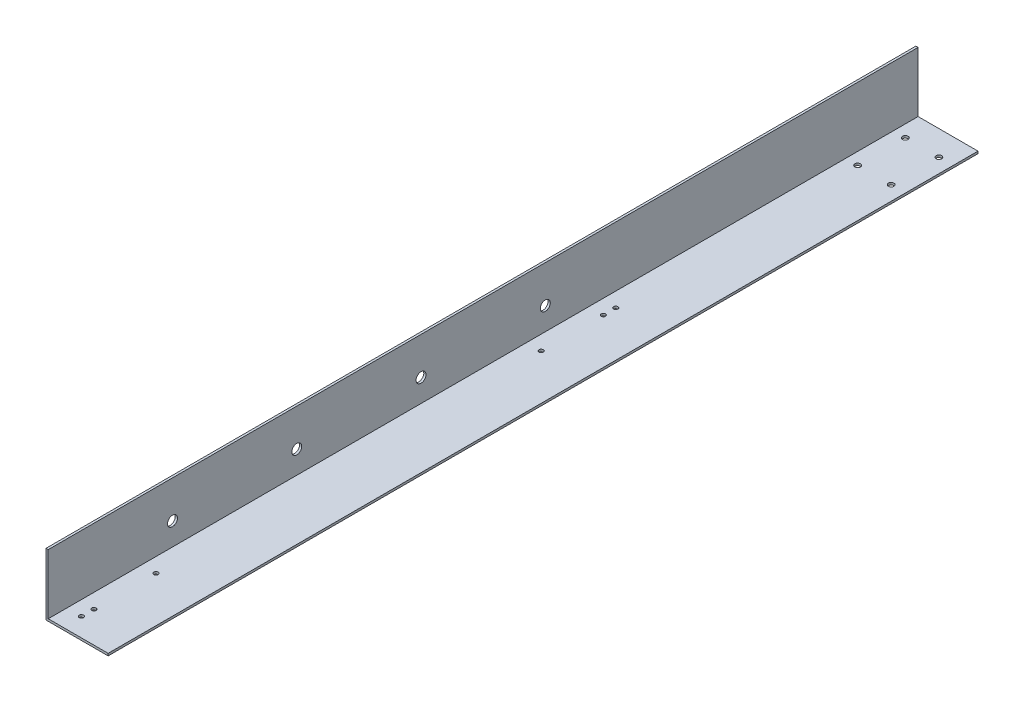
ISO-10303-21;
HEADER;
FILE_DESCRIPTION(('STEP AP214'),'2;1');
FILE_NAME('part.step','',(''),(''),'','','');
FILE_SCHEMA(('AUTOMOTIVE_DESIGN { 1 0 10303 214 1 1 1 1 }'));
ENDSEC;
DATA;
#1=APPLICATION_CONTEXT('core data for automotive mechanical design processes');
#2=APPLICATION_PROTOCOL_DEFINITION('international standard','automotive_design',2000,#1);
#3=PRODUCT_CONTEXT('',#1,'mechanical');
#4=PRODUCT('Part','Part','',(#3));
#5=PRODUCT_RELATED_PRODUCT_CATEGORY('part','',(#4));
#6=PRODUCT_DEFINITION_FORMATION('','',#4);
#7=PRODUCT_DEFINITION_CONTEXT('part definition',#1,'design');
#8=PRODUCT_DEFINITION('design','',#6,#7);
#9=PRODUCT_DEFINITION_SHAPE('','',#8);
#10=(LENGTH_UNIT() NAMED_UNIT(*) SI_UNIT(.MILLI.,.METRE.));
#11=(NAMED_UNIT(*) PLANE_ANGLE_UNIT() SI_UNIT($,.RADIAN.));
#12=(NAMED_UNIT(*) SI_UNIT($,.STERADIAN.) SOLID_ANGLE_UNIT());
#13=UNCERTAINTY_MEASURE_WITH_UNIT(LENGTH_MEASURE(1.E-05),#10,'distance_accuracy_value','');
#14=(GEOMETRIC_REPRESENTATION_CONTEXT(3) GLOBAL_UNCERTAINTY_ASSIGNED_CONTEXT((#13)) GLOBAL_UNIT_ASSIGNED_CONTEXT((#10,
#11,#12)) REPRESENTATION_CONTEXT('',''));
#15=CARTESIAN_POINT('',(0.,0.,0.));
#16=DIRECTION('',(0.,0.,1.));
#17=DIRECTION('',(1.,0.,0.));
#18=AXIS2_PLACEMENT_3D('',#15,#16,#17);
#19=CARTESIAN_POINT('',(0.,0.,700.));
#20=DIRECTION('',(0.,1.,0.));
#21=DIRECTION('',(0.,0.,1.));
#22=AXIS2_PLACEMENT_3D('',#19,#20,#21);
#23=PLANE('',#22);
#24=CARTESIAN_POINT('',(13.5,0.,685.));
#25=DIRECTION('',(0.,-1.,0.));
#26=DIRECTION('',(0.,0.,-1.));
#27=AXIS2_PLACEMENT_3D('',#24,#25,#26);
#28=CIRCLE('',#27,1.75);
#29=CARTESIAN_POINT('',(13.5,0.,683.25));
#30=VERTEX_POINT('',#29);
#31=EDGE_CURVE('E292',#30,#30,#28,.T.);
#32=ORIENTED_EDGE('',*,*,#31,.F.);
#33=EDGE_LOOP('',(#32));
#34=FACE_BOUND('',#33,.T.);
#35=CARTESIAN_POINT('',(13.5,0.,675.));
#36=DIRECTION('',(0.,-1.,0.));
#37=DIRECTION('',(0.,0.,-1.));
#38=AXIS2_PLACEMENT_3D('',#35,#36,#37);
#39=CIRCLE('',#38,1.75);
#40=CARTESIAN_POINT('',(13.5,0.,673.25));
#41=VERTEX_POINT('',#40);
#42=EDGE_CURVE('E294',#41,#41,#39,.T.);
#43=ORIENTED_EDGE('',*,*,#42,.F.);
#44=EDGE_LOOP('',(#43));
#45=FACE_BOUND('',#44,.T.);
#46=CARTESIAN_POINT('',(13.5,0.,625.));
#47=DIRECTION('',(0.,-1.,0.));
#48=DIRECTION('',(0.,0.,-1.));
#49=AXIS2_PLACEMENT_3D('',#46,#47,#48);
#50=CIRCLE('',#49,1.75);
#51=CARTESIAN_POINT('',(13.5,0.,623.25));
#52=VERTEX_POINT('',#51);
#53=EDGE_CURVE('E302',#52,#52,#50,.T.);
#54=ORIENTED_EDGE('',*,*,#53,.F.);
#55=EDGE_LOOP('',(#54));
#56=FACE_BOUND('',#55,.T.);
#57=CARTESIAN_POINT('',(13.5,0.,255.));
#58=DIRECTION('',(0.,-1.,0.));
#59=DIRECTION('',(0.,0.,-1.));
#60=AXIS2_PLACEMENT_3D('',#57,#58,#59);
#61=CIRCLE('',#60,1.75);
#62=CARTESIAN_POINT('',(13.5,0.,253.25));
#63=VERTEX_POINT('',#62);
#64=EDGE_CURVE('E308',#63,#63,#61,.T.);
#65=ORIENTED_EDGE('',*,*,#64,.F.);
#66=EDGE_LOOP('',(#65));
#67=FACE_BOUND('',#66,.T.);
#68=CARTESIAN_POINT('',(13.5,0.,265.));
#69=DIRECTION('',(0.,-1.,0.));
#70=DIRECTION('',(0.,0.,-1.));
#71=AXIS2_PLACEMENT_3D('',#68,#69,#70);
#72=CIRCLE('',#71,1.75);
#73=CARTESIAN_POINT('',(13.5,0.,263.25));
#74=VERTEX_POINT('',#73);
#75=EDGE_CURVE('E314',#74,#74,#72,.T.);
#76=ORIENTED_EDGE('',*,*,#75,.F.);
#77=EDGE_LOOP('',(#76));
#78=FACE_BOUND('',#77,.T.);
#79=DIRECTION('',(1.,0.,0.));
#80=VECTOR('',#79,1.);
#81=CARTESIAN_POINT('',(0.,0.,0.));
#82=LINE('',#81,#80);
#83=CARTESIAN_POINT('',(0.,0.,0.));
#84=VERTEX_POINT('',#83);
#85=CARTESIAN_POINT('',(50.,0.,0.));
#86=VERTEX_POINT('',#85);
#87=EDGE_CURVE('E110',#84,#86,#82,.T.);
#88=ORIENTED_EDGE('',*,*,#87,.T.);
#89=DIRECTION('',(0.,0.,-1.));
#90=VECTOR('',#89,1.);
#91=CARTESIAN_POINT('',(50.,0.,700.));
#92=LINE('',#91,#90);
#93=CARTESIAN_POINT('',(50.,0.,700.));
#94=VERTEX_POINT('',#93);
#95=EDGE_CURVE('E107',#94,#86,#92,.T.);
#96=ORIENTED_EDGE('',*,*,#95,.F.);
#97=DIRECTION('',(1.,0.,0.));
#98=VECTOR('',#97,1.);
#99=CARTESIAN_POINT('',(0.,0.,700.));
#100=LINE('',#99,#98);
#101=CARTESIAN_POINT('',(0.,0.,700.));
#102=VERTEX_POINT('',#101);
#103=EDGE_CURVE('E95',#102,#94,#100,.T.);
#104=ORIENTED_EDGE('',*,*,#103,.F.);
#105=DIRECTION('',(0.,0.,-1.));
#106=VECTOR('',#105,1.);
#107=CARTESIAN_POINT('',(0.,0.,700.));
#108=LINE('',#107,#106);
#109=EDGE_CURVE('E45',#102,#84,#108,.T.);
#110=ORIENTED_EDGE('',*,*,#109,.T.);
#111=EDGE_LOOP('',(#88,#96,#104,#110));
#112=FACE_BOUND('',#111,.T.);
#113=CARTESIAN_POINT('',(38.5,0.,20.));
#114=DIRECTION('',(0.,-1.,0.));
#115=DIRECTION('',(0.,0.,-1.));
#116=AXIS2_PLACEMENT_3D('',#113,#114,#115);
#117=CIRCLE('',#116,2.25);
#118=CARTESIAN_POINT('',(38.5,0.,17.75));
#119=VERTEX_POINT('',#118);
#120=EDGE_CURVE('E146',#119,#119,#117,.T.);
#121=ORIENTED_EDGE('',*,*,#120,.F.);
#122=EDGE_LOOP('',(#121));
#123=FACE_BOUND('',#122,.T.);
#124=CARTESIAN_POINT('',(38.5,0.,58.34));
#125=DIRECTION('',(0.,-1.,0.));
#126=DIRECTION('',(0.,0.,-1.));
#127=AXIS2_PLACEMENT_3D('',#124,#125,#126);
#128=CIRCLE('',#127,2.25);
#129=CARTESIAN_POINT('',(38.5,0.,56.09));
#130=VERTEX_POINT('',#129);
#131=EDGE_CURVE('E150',#130,#130,#128,.T.);
#132=ORIENTED_EDGE('',*,*,#131,.F.);
#133=EDGE_LOOP('',(#132));
#134=FACE_BOUND('',#133,.T.);
#135=CARTESIAN_POINT('',(11.5,0.,20.));
#136=DIRECTION('',(0.,-1.,0.));
#137=DIRECTION('',(0.,0.,-1.));
#138=AXIS2_PLACEMENT_3D('',#135,#136,#137);
#139=CIRCLE('',#138,2.25);
#140=CARTESIAN_POINT('',(11.5,0.,17.75));
#141=VERTEX_POINT('',#140);
#142=EDGE_CURVE('E154',#141,#141,#139,.T.);
#143=ORIENTED_EDGE('',*,*,#142,.F.);
#144=EDGE_LOOP('',(#143));
#145=FACE_BOUND('',#144,.T.);
#146=CARTESIAN_POINT('',(11.5,0.,58.34));
#147=DIRECTION('',(0.,-1.,0.));
#148=DIRECTION('',(0.,0.,-1.));
#149=AXIS2_PLACEMENT_3D('',#146,#147,#148);
#150=CIRCLE('',#149,2.25);
#151=CARTESIAN_POINT('',(11.5,0.,56.09));
#152=VERTEX_POINT('',#151);
#153=EDGE_CURVE('E158',#152,#152,#150,.T.);
#154=ORIENTED_EDGE('',*,*,#153,.F.);
#155=EDGE_LOOP('',(#154));
#156=FACE_BOUND('',#155,.T.);
#157=CARTESIAN_POINT('',(13.5,0.,315.));
#158=DIRECTION('',(0.,-1.,0.));
#159=DIRECTION('',(0.,0.,-1.));
#160=AXIS2_PLACEMENT_3D('',#157,#158,#159);
#161=CIRCLE('',#160,1.75);
#162=CARTESIAN_POINT('',(13.5,0.,313.25));
#163=VERTEX_POINT('',#162);
#164=EDGE_CURVE('E182',#163,#163,#161,.T.);
#165=ORIENTED_EDGE('',*,*,#164,.F.);
#166=EDGE_LOOP('',(#165));
#167=FACE_BOUND('',#166,.T.);
#168=ADVANCED_FACE('F35',(#34,#45,#56,#67,#78,#112,#123,#134,#145,#156,#167),#23,.F.);
#169=CARTESIAN_POINT('',(0.,50.,700.));
#170=DIRECTION('',(0.,1.,0.));
#171=DIRECTION('',(-1.,0.,0.));
#172=AXIS2_PLACEMENT_3D('',#169,#170,#171);
#173=PLANE('',#172);
#174=DIRECTION('',(1.,0.,0.));
#175=VECTOR('',#174,1.);
#176=CARTESIAN_POINT('',(0.,50.,0.));
#177=LINE('',#176,#175);
#178=CARTESIAN_POINT('',(0.,50.,0.));
#179=VERTEX_POINT('',#178);
#180=CARTESIAN_POINT('',(1.8,50.,0.));
#181=VERTEX_POINT('',#180);
#182=EDGE_CURVE('E124',#179,#181,#177,.T.);
#183=ORIENTED_EDGE('',*,*,#182,.F.);
#184=DIRECTION('',(0.,0.,-1.));
#185=VECTOR('',#184,1.);
#186=CARTESIAN_POINT('',(0.,50.,700.));
#187=LINE('',#186,#185);
#188=CARTESIAN_POINT('',(0.,50.,700.));
#189=VERTEX_POINT('',#188);
#190=EDGE_CURVE('E11',#189,#179,#187,.T.);
#191=ORIENTED_EDGE('',*,*,#190,.F.);
#192=DIRECTION('',(1.,0.,0.));
#193=VECTOR('',#192,1.);
#194=CARTESIAN_POINT('',(0.,50.,700.));
#195=LINE('',#194,#193);
#196=CARTESIAN_POINT('',(1.8,50.,700.));
#197=VERTEX_POINT('',#196);
#198=EDGE_CURVE('E137',#189,#197,#195,.T.);
#199=ORIENTED_EDGE('',*,*,#198,.T.);
#200=DIRECTION('',(0.,0.,-1.));
#201=VECTOR('',#200,1.);
#202=CARTESIAN_POINT('',(1.8,50.,700.));
#203=LINE('',#202,#201);
#204=EDGE_CURVE('E84',#197,#181,#203,.T.);
#205=ORIENTED_EDGE('',*,*,#204,.T.);
#206=EDGE_LOOP('',(#183,#191,#199,#205));
#207=FACE_BOUND('',#206,.T.);
#208=ADVANCED_FACE('F37',(#207),#173,.T.);
#209=CARTESIAN_POINT('',(0.,50.,700.));
#210=DIRECTION('',(1.,0.,0.));
#211=DIRECTION('',(0.,1.,0.));
#212=AXIS2_PLACEMENT_3D('',#209,#210,#211);
#213=PLANE('',#212);
#214=CARTESIAN_POINT('',(0.,20.,300.));
#215=DIRECTION('',(-1.,0.,0.));
#216=DIRECTION('',(0.,-1.,0.));
#217=AXIS2_PLACEMENT_3D('',#214,#215,#216);
#218=CIRCLE('',#217,3.99999999999994);
#219=CARTESIAN_POINT('',(0.,16.,300.));
#220=VERTEX_POINT('',#219);
#221=EDGE_CURVE('E172',#220,#220,#218,.T.);
#222=ORIENTED_EDGE('',*,*,#221,.F.);
#223=EDGE_LOOP('',(#222));
#224=FACE_BOUND('',#223,.T.);
#225=CARTESIAN_POINT('',(0.,20.,400.));
#226=DIRECTION('',(-1.,0.,0.));
#227=DIRECTION('',(0.,-1.,0.));
#228=AXIS2_PLACEMENT_3D('',#225,#226,#227);
#229=CIRCLE('',#228,3.99999999999999);
#230=CARTESIAN_POINT('',(0.,16.,400.));
#231=VERTEX_POINT('',#230);
#232=EDGE_CURVE('E169',#231,#231,#229,.T.);
#233=ORIENTED_EDGE('',*,*,#232,.F.);
#234=EDGE_LOOP('',(#233));
#235=FACE_BOUND('',#234,.T.);
#236=CARTESIAN_POINT('',(0.,20.,500.));
#237=DIRECTION('',(-1.,0.,0.));
#238=DIRECTION('',(0.,-1.,0.));
#239=AXIS2_PLACEMENT_3D('',#236,#237,#238);
#240=CIRCLE('',#239,3.99999999999994);
#241=CARTESIAN_POINT('',(0.,16.,500.));
#242=VERTEX_POINT('',#241);
#243=EDGE_CURVE('E166',#242,#242,#240,.T.);
#244=ORIENTED_EDGE('',*,*,#243,.F.);
#245=EDGE_LOOP('',(#244));
#246=FACE_BOUND('',#245,.T.);
#247=CARTESIAN_POINT('',(0.,20.,600.));
#248=DIRECTION('',(-1.,0.,0.));
#249=DIRECTION('',(0.,-1.,0.));
#250=AXIS2_PLACEMENT_3D('',#247,#248,#249);
#251=CIRCLE('',#250,3.99999999999999);
#252=CARTESIAN_POINT('',(0.,16.,600.));
#253=VERTEX_POINT('',#252);
#254=EDGE_CURVE('E162',#253,#253,#251,.T.);
#255=ORIENTED_EDGE('',*,*,#254,.F.);
#256=EDGE_LOOP('',(#255));
#257=FACE_BOUND('',#256,.T.);
#258=DIRECTION('',(0.,-1.,0.));
#259=VECTOR('',#258,1.);
#260=CARTESIAN_POINT('',(0.,50.,0.));
#261=LINE('',#260,#259);
#262=EDGE_CURVE('E75',#179,#84,#261,.T.);
#263=ORIENTED_EDGE('',*,*,#262,.T.);
#264=ORIENTED_EDGE('',*,*,#109,.F.);
#265=DIRECTION('',(0.,-1.,0.));
#266=VECTOR('',#265,1.);
#267=CARTESIAN_POINT('',(0.,50.,700.));
#268=LINE('',#267,#266);
#269=EDGE_CURVE('E103',#189,#102,#268,.T.);
#270=ORIENTED_EDGE('',*,*,#269,.F.);
#271=ORIENTED_EDGE('',*,*,#190,.T.);
#272=EDGE_LOOP('',(#263,#264,#270,#271));
#273=FACE_BOUND('',#272,.T.);
#274=ADVANCED_FACE('F212',(#224,#235,#246,#257,#273),#213,.F.);
#275=CARTESIAN_POINT('',(50.,1.8,700.));
#276=DIRECTION('',(1.,0.,0.));
#277=DIRECTION('',(0.,0.,-1.));
#278=AXIS2_PLACEMENT_3D('',#275,#276,#277);
#279=PLANE('',#278);
#280=DIRECTION('',(0.,-1.,0.));
#281=VECTOR('',#280,1.);
#282=CARTESIAN_POINT('',(50.,1.8,0.));
#283=LINE('',#282,#281);
#284=CARTESIAN_POINT('',(50.,1.8,0.));
#285=VERTEX_POINT('',#284);
#286=EDGE_CURVE('E134',#285,#86,#283,.T.);
#287=ORIENTED_EDGE('',*,*,#286,.F.);
#288=DIRECTION('',(0.,0.,-1.));
#289=VECTOR('',#288,1.);
#290=CARTESIAN_POINT('',(50.,1.8,700.));
#291=LINE('',#290,#289);
#292=CARTESIAN_POINT('',(50.,1.8,700.));
#293=VERTEX_POINT('',#292);
#294=EDGE_CURVE('E114',#293,#285,#291,.T.);
#295=ORIENTED_EDGE('',*,*,#294,.F.);
#296=DIRECTION('',(0.,-1.,0.));
#297=VECTOR('',#296,1.);
#298=CARTESIAN_POINT('',(50.,1.8,700.));
#299=LINE('',#298,#297);
#300=EDGE_CURVE('E101',#293,#94,#299,.T.);
#301=ORIENTED_EDGE('',*,*,#300,.T.);
#302=ORIENTED_EDGE('',*,*,#95,.T.);
#303=EDGE_LOOP('',(#287,#295,#301,#302));
#304=FACE_BOUND('',#303,.T.);
#305=ADVANCED_FACE('F116',(#304),#279,.T.);
#306=CARTESIAN_POINT('',(1.80000000000001,1.8,700.));
#307=DIRECTION('',(0.,1.,0.));
#308=DIRECTION('',(0.,0.,1.));
#309=AXIS2_PLACEMENT_3D('',#306,#307,#308);
#310=PLANE('',#309);
#311=CARTESIAN_POINT('',(13.5,1.8,685.));
#312=DIRECTION('',(0.,1.,0.));
#313=DIRECTION('',(0.,0.,1.));
#314=AXIS2_PLACEMENT_3D('',#311,#312,#313);
#315=CIRCLE('',#314,1.75);
#316=CARTESIAN_POINT('',(13.5,1.8,686.75));
#317=VERTEX_POINT('',#316);
#318=EDGE_CURVE('E290',#317,#317,#315,.T.);
#319=ORIENTED_EDGE('',*,*,#318,.F.);
#320=EDGE_LOOP('',(#319));
#321=FACE_BOUND('',#320,.T.);
#322=CARTESIAN_POINT('',(13.5,1.8,675.));
#323=DIRECTION('',(0.,1.,0.));
#324=DIRECTION('',(0.,0.,1.));
#325=AXIS2_PLACEMENT_3D('',#322,#323,#324);
#326=CIRCLE('',#325,1.75);
#327=CARTESIAN_POINT('',(13.5,1.8,676.75));
#328=VERTEX_POINT('',#327);
#329=EDGE_CURVE('E299',#328,#328,#326,.T.);
#330=ORIENTED_EDGE('',*,*,#329,.F.);
#331=EDGE_LOOP('',(#330));
#332=FACE_BOUND('',#331,.T.);
#333=CARTESIAN_POINT('',(13.5,1.8,625.));
#334=DIRECTION('',(0.,1.,0.));
#335=DIRECTION('',(0.,0.,1.));
#336=AXIS2_PLACEMENT_3D('',#333,#334,#335);
#337=CIRCLE('',#336,1.75);
#338=CARTESIAN_POINT('',(13.5,1.8,626.75));
#339=VERTEX_POINT('',#338);
#340=EDGE_CURVE('E305',#339,#339,#337,.T.);
#341=ORIENTED_EDGE('',*,*,#340,.F.);
#342=EDGE_LOOP('',(#341));
#343=FACE_BOUND('',#342,.T.);
#344=CARTESIAN_POINT('',(13.5,1.8,255.));
#345=DIRECTION('',(0.,1.,0.));
#346=DIRECTION('',(0.,0.,1.));
#347=AXIS2_PLACEMENT_3D('',#344,#345,#346);
#348=CIRCLE('',#347,1.75);
#349=CARTESIAN_POINT('',(13.5,1.8,256.75));
#350=VERTEX_POINT('',#349);
#351=EDGE_CURVE('E311',#350,#350,#348,.T.);
#352=ORIENTED_EDGE('',*,*,#351,.F.);
#353=EDGE_LOOP('',(#352));
#354=FACE_BOUND('',#353,.T.);
#355=CARTESIAN_POINT('',(13.5,1.8,265.));
#356=DIRECTION('',(0.,1.,0.));
#357=DIRECTION('',(0.,0.,1.));
#358=AXIS2_PLACEMENT_3D('',#355,#356,#357);
#359=CIRCLE('',#358,1.75);
#360=CARTESIAN_POINT('',(13.5,1.8,266.75));
#361=VERTEX_POINT('',#360);
#362=EDGE_CURVE('E316',#361,#361,#359,.T.);
#363=ORIENTED_EDGE('',*,*,#362,.F.);
#364=EDGE_LOOP('',(#363));
#365=FACE_BOUND('',#364,.T.);
#366=CARTESIAN_POINT('',(13.5,1.8,315.));
#367=DIRECTION('',(0.,1.,0.));
#368=DIRECTION('',(0.,0.,1.));
#369=AXIS2_PLACEMENT_3D('',#366,#367,#368);
#370=CIRCLE('',#369,1.75);
#371=CARTESIAN_POINT('',(13.5,1.8,316.75));
#372=VERTEX_POINT('',#371);
#373=EDGE_CURVE('E39',#372,#372,#370,.T.);
#374=ORIENTED_EDGE('',*,*,#373,.F.);
#375=EDGE_LOOP('',(#374));
#376=FACE_BOUND('',#375,.T.);
#377=CARTESIAN_POINT('',(11.5,1.8,58.34));
#378=DIRECTION('',(0.,1.,0.));
#379=DIRECTION('',(0.,0.,1.));
#380=AXIS2_PLACEMENT_3D('',#377,#378,#379);
#381=CIRCLE('',#380,2.25);
#382=CARTESIAN_POINT('',(11.5,1.8,60.59));
#383=VERTEX_POINT('',#382);
#384=EDGE_CURVE('E155',#383,#383,#381,.T.);
#385=ORIENTED_EDGE('',*,*,#384,.F.);
#386=EDGE_LOOP('',(#385));
#387=FACE_BOUND('',#386,.T.);
#388=CARTESIAN_POINT('',(11.5,1.8,20.));
#389=DIRECTION('',(0.,1.,0.));
#390=DIRECTION('',(0.,0.,1.));
#391=AXIS2_PLACEMENT_3D('',#388,#389,#390);
#392=CIRCLE('',#391,2.25);
#393=CARTESIAN_POINT('',(11.5,1.8,22.25));
#394=VERTEX_POINT('',#393);
#395=EDGE_CURVE('E151',#394,#394,#392,.T.);
#396=ORIENTED_EDGE('',*,*,#395,.F.);
#397=EDGE_LOOP('',(#396));
#398=FACE_BOUND('',#397,.T.);
#399=CARTESIAN_POINT('',(38.5,1.8,58.34));
#400=DIRECTION('',(0.,1.,0.));
#401=DIRECTION('',(0.,0.,1.));
#402=AXIS2_PLACEMENT_3D('',#399,#400,#401);
#403=CIRCLE('',#402,2.25);
#404=CARTESIAN_POINT('',(38.5,1.8,60.59));
#405=VERTEX_POINT('',#404);
#406=EDGE_CURVE('E147',#405,#405,#403,.T.);
#407=ORIENTED_EDGE('',*,*,#406,.F.);
#408=EDGE_LOOP('',(#407));
#409=FACE_BOUND('',#408,.T.);
#410=CARTESIAN_POINT('',(38.5,1.8,20.));
#411=DIRECTION('',(0.,1.,0.));
#412=DIRECTION('',(0.,0.,1.));
#413=AXIS2_PLACEMENT_3D('',#410,#411,#412);
#414=CIRCLE('',#413,2.25);
#415=CARTESIAN_POINT('',(38.5,1.8,22.25));
#416=VERTEX_POINT('',#415);
#417=EDGE_CURVE('E128',#416,#416,#414,.T.);
#418=ORIENTED_EDGE('',*,*,#417,.F.);
#419=EDGE_LOOP('',(#418));
#420=FACE_BOUND('',#419,.T.);
#421=DIRECTION('',(1.,0.,0.));
#422=VECTOR('',#421,1.);
#423=CARTESIAN_POINT('',(1.80000000000001,1.8,0.));
#424=LINE('',#423,#422);
#425=CARTESIAN_POINT('',(1.80000000000001,1.8,0.));
#426=VERTEX_POINT('',#425);
#427=EDGE_CURVE('E131',#426,#285,#424,.T.);
#428=ORIENTED_EDGE('',*,*,#427,.F.);
#429=DIRECTION('',(0.,0.,-1.));
#430=VECTOR('',#429,1.);
#431=CARTESIAN_POINT('',(1.80000000000001,1.8,700.));
#432=LINE('',#431,#430);
#433=CARTESIAN_POINT('',(1.80000000000001,1.8,700.));
#434=VERTEX_POINT('',#433);
#435=EDGE_CURVE('E141',#434,#426,#432,.T.);
#436=ORIENTED_EDGE('',*,*,#435,.F.);
#437=DIRECTION('',(1.,0.,0.));
#438=VECTOR('',#437,1.);
#439=CARTESIAN_POINT('',(1.80000000000001,1.8,700.));
#440=LINE('',#439,#438);
#441=EDGE_CURVE('E117',#434,#293,#440,.T.);
#442=ORIENTED_EDGE('',*,*,#441,.T.);
#443=ORIENTED_EDGE('',*,*,#294,.T.);
#444=EDGE_LOOP('',(#428,#436,#442,#443));
#445=FACE_BOUND('',#444,.T.);
#446=ADVANCED_FACE('F203',(#321,#332,#343,#354,#365,#376,#387,#398,#409,#420,#445),#310,.T.);
#447=CARTESIAN_POINT('',(1.8,50.,700.));
#448=DIRECTION('',(1.,0.,0.));
#449=DIRECTION('',(0.,1.,0.));
#450=AXIS2_PLACEMENT_3D('',#447,#448,#449);
#451=PLANE('',#450);
#452=CARTESIAN_POINT('',(1.80000000000001,20.,300.));
#453=DIRECTION('',(1.,0.,0.));
#454=DIRECTION('',(0.,1.,0.));
#455=AXIS2_PLACEMENT_3D('',#452,#453,#454);
#456=CIRCLE('',#455,3.99999999999994);
#457=CARTESIAN_POINT('',(1.80000000000001,23.9999999999999,300.));
#458=VERTEX_POINT('',#457);
#459=EDGE_CURVE('E170',#458,#458,#456,.T.);
#460=ORIENTED_EDGE('',*,*,#459,.F.);
#461=EDGE_LOOP('',(#460));
#462=FACE_BOUND('',#461,.T.);
#463=CARTESIAN_POINT('',(1.80000000000001,20.,400.));
#464=DIRECTION('',(1.,0.,0.));
#465=DIRECTION('',(0.,1.,0.));
#466=AXIS2_PLACEMENT_3D('',#463,#464,#465);
#467=CIRCLE('',#466,3.99999999999999);
#468=CARTESIAN_POINT('',(1.80000000000001,24.,400.));
#469=VERTEX_POINT('',#468);
#470=EDGE_CURVE('E167',#469,#469,#467,.T.);
#471=ORIENTED_EDGE('',*,*,#470,.F.);
#472=EDGE_LOOP('',(#471));
#473=FACE_BOUND('',#472,.T.);
#474=CARTESIAN_POINT('',(1.80000000000001,20.,500.));
#475=DIRECTION('',(1.,0.,0.));
#476=DIRECTION('',(0.,1.,0.));
#477=AXIS2_PLACEMENT_3D('',#474,#475,#476);
#478=CIRCLE('',#477,3.99999999999994);
#479=CARTESIAN_POINT('',(1.80000000000001,23.9999999999999,500.));
#480=VERTEX_POINT('',#479);
#481=EDGE_CURVE('E163',#480,#480,#478,.T.);
#482=ORIENTED_EDGE('',*,*,#481,.F.);
#483=EDGE_LOOP('',(#482));
#484=FACE_BOUND('',#483,.T.);
#485=CARTESIAN_POINT('',(1.80000000000001,20.,600.));
#486=DIRECTION('',(1.,0.,0.));
#487=DIRECTION('',(0.,1.,0.));
#488=AXIS2_PLACEMENT_3D('',#485,#486,#487);
#489=CIRCLE('',#488,3.99999999999999);
#490=CARTESIAN_POINT('',(1.80000000000001,24.,600.));
#491=VERTEX_POINT('',#490);
#492=EDGE_CURVE('E159',#491,#491,#489,.T.);
#493=ORIENTED_EDGE('',*,*,#492,.F.);
#494=EDGE_LOOP('',(#493));
#495=FACE_BOUND('',#494,.T.);
#496=DIRECTION('',(0.,-1.,0.));
#497=VECTOR('',#496,1.);
#498=CARTESIAN_POINT('',(1.8,50.,0.));
#499=LINE('',#498,#497);
#500=EDGE_CURVE('E127',#181,#426,#499,.T.);
#501=ORIENTED_EDGE('',*,*,#500,.F.);
#502=ORIENTED_EDGE('',*,*,#204,.F.);
#503=DIRECTION('',(0.,-1.,0.));
#504=VECTOR('',#503,1.);
#505=CARTESIAN_POINT('',(1.8,50.,700.));
#506=LINE('',#505,#504);
#507=EDGE_CURVE('E119',#197,#434,#506,.T.);
#508=ORIENTED_EDGE('',*,*,#507,.T.);
#509=ORIENTED_EDGE('',*,*,#435,.T.);
#510=EDGE_LOOP('',(#501,#502,#508,#509));
#511=FACE_BOUND('',#510,.T.);
#512=ADVANCED_FACE('F198',(#462,#473,#484,#495,#511),#451,.T.);
#513=CARTESIAN_POINT('',(0.,0.,700.));
#514=DIRECTION('',(0.,0.,-1.));
#515=DIRECTION('',(-1.,0.,0.));
#516=AXIS2_PLACEMENT_3D('',#513,#514,#515);
#517=PLANE('',#516);
#518=ORIENTED_EDGE('',*,*,#198,.F.);
#519=ORIENTED_EDGE('',*,*,#269,.T.);
#520=ORIENTED_EDGE('',*,*,#103,.T.);
#521=ORIENTED_EDGE('',*,*,#300,.F.);
#522=ORIENTED_EDGE('',*,*,#441,.F.);
#523=ORIENTED_EDGE('',*,*,#507,.F.);
#524=EDGE_LOOP('',(#518,#519,#520,#521,#522,#523));
#525=FACE_BOUND('',#524,.T.);
#526=ADVANCED_FACE('F98',(#525),#517,.F.);
#527=CARTESIAN_POINT('',(0.,0.,0.));
#528=DIRECTION('',(0.,0.,-1.));
#529=DIRECTION('',(-1.,0.,0.));
#530=AXIS2_PLACEMENT_3D('',#527,#528,#529);
#531=PLANE('',#530);
#532=ORIENTED_EDGE('',*,*,#182,.T.);
#533=ORIENTED_EDGE('',*,*,#500,.T.);
#534=ORIENTED_EDGE('',*,*,#427,.T.);
#535=ORIENTED_EDGE('',*,*,#286,.T.);
#536=ORIENTED_EDGE('',*,*,#87,.F.);
#537=ORIENTED_EDGE('',*,*,#262,.F.);
#538=EDGE_LOOP('',(#532,#533,#534,#535,#536,#537));
#539=FACE_BOUND('',#538,.T.);
#540=ADVANCED_FACE('F201',(#539),#531,.T.);
#541=CARTESIAN_POINT('',(38.5,10.,20.));
#542=DIRECTION('',(0.,-1.,0.));
#543=DIRECTION('',(0.,0.,-1.));
#544=AXIS2_PLACEMENT_3D('',#541,#542,#543);
#545=CYLINDRICAL_SURFACE('',#544,2.25);
#546=ORIENTED_EDGE('',*,*,#417,.T.);
#547=EDGE_LOOP('',(#546));
#548=FACE_BOUND('',#547,.T.);
#549=ORIENTED_EDGE('',*,*,#120,.T.);
#550=EDGE_LOOP('',(#549));
#551=FACE_BOUND('',#550,.T.);
#552=ADVANCED_FACE('F230',(#548,#551),#545,.F.);
#553=CARTESIAN_POINT('',(38.5,10.,58.34));
#554=DIRECTION('',(0.,-1.,0.));
#555=DIRECTION('',(0.,0.,-1.));
#556=AXIS2_PLACEMENT_3D('',#553,#554,#555);
#557=CYLINDRICAL_SURFACE('',#556,2.25);
#558=ORIENTED_EDGE('',*,*,#406,.T.);
#559=EDGE_LOOP('',(#558));
#560=FACE_BOUND('',#559,.T.);
#561=ORIENTED_EDGE('',*,*,#131,.T.);
#562=EDGE_LOOP('',(#561));
#563=FACE_BOUND('',#562,.T.);
#564=ADVANCED_FACE('F235',(#560,#563),#557,.F.);
#565=CARTESIAN_POINT('',(11.5,10.,20.));
#566=DIRECTION('',(0.,-1.,0.));
#567=DIRECTION('',(0.,0.,-1.));
#568=AXIS2_PLACEMENT_3D('',#565,#566,#567);
#569=CYLINDRICAL_SURFACE('',#568,2.25);
#570=ORIENTED_EDGE('',*,*,#395,.T.);
#571=EDGE_LOOP('',(#570));
#572=FACE_BOUND('',#571,.T.);
#573=ORIENTED_EDGE('',*,*,#142,.T.);
#574=EDGE_LOOP('',(#573));
#575=FACE_BOUND('',#574,.T.);
#576=ADVANCED_FACE('F239',(#572,#575),#569,.F.);
#577=CARTESIAN_POINT('',(11.5,10.,58.34));
#578=DIRECTION('',(0.,-1.,0.));
#579=DIRECTION('',(0.,0.,-1.));
#580=AXIS2_PLACEMENT_3D('',#577,#578,#579);
#581=CYLINDRICAL_SURFACE('',#580,2.25);
#582=ORIENTED_EDGE('',*,*,#384,.T.);
#583=EDGE_LOOP('',(#582));
#584=FACE_BOUND('',#583,.T.);
#585=ORIENTED_EDGE('',*,*,#153,.T.);
#586=EDGE_LOOP('',(#585));
#587=FACE_BOUND('',#586,.T.);
#588=ADVANCED_FACE('F243',(#584,#587),#581,.F.);
#589=CARTESIAN_POINT('',(50.,20.,600.));
#590=DIRECTION('',(-1.,0.,0.));
#591=DIRECTION('',(0.,-1.,0.));
#592=AXIS2_PLACEMENT_3D('',#589,#590,#591);
#593=CYLINDRICAL_SURFACE('',#592,3.99999999999999);
#594=ORIENTED_EDGE('',*,*,#492,.T.);
#595=EDGE_LOOP('',(#594));
#596=FACE_BOUND('',#595,.T.);
#597=ORIENTED_EDGE('',*,*,#254,.T.);
#598=EDGE_LOOP('',(#597));
#599=FACE_BOUND('',#598,.T.);
#600=ADVANCED_FACE('F247',(#596,#599),#593,.F.);
#601=CARTESIAN_POINT('',(50.,20.,500.));
#602=DIRECTION('',(-1.,0.,0.));
#603=DIRECTION('',(0.,-1.,0.));
#604=AXIS2_PLACEMENT_3D('',#601,#602,#603);
#605=CYLINDRICAL_SURFACE('',#604,3.99999999999994);
#606=ORIENTED_EDGE('',*,*,#481,.T.);
#607=EDGE_LOOP('',(#606));
#608=FACE_BOUND('',#607,.T.);
#609=ORIENTED_EDGE('',*,*,#243,.T.);
#610=EDGE_LOOP('',(#609));
#611=FACE_BOUND('',#610,.T.);
#612=ADVANCED_FACE('F251',(#608,#611),#605,.F.);
#613=CARTESIAN_POINT('',(50.,20.,400.));
#614=DIRECTION('',(-1.,0.,0.));
#615=DIRECTION('',(0.,-1.,0.));
#616=AXIS2_PLACEMENT_3D('',#613,#614,#615);
#617=CYLINDRICAL_SURFACE('',#616,3.99999999999999);
#618=ORIENTED_EDGE('',*,*,#470,.T.);
#619=EDGE_LOOP('',(#618));
#620=FACE_BOUND('',#619,.T.);
#621=ORIENTED_EDGE('',*,*,#232,.T.);
#622=EDGE_LOOP('',(#621));
#623=FACE_BOUND('',#622,.T.);
#624=ADVANCED_FACE('F255',(#620,#623),#617,.F.);
#625=CARTESIAN_POINT('',(50.,20.,300.));
#626=DIRECTION('',(-1.,0.,0.));
#627=DIRECTION('',(0.,-1.,0.));
#628=AXIS2_PLACEMENT_3D('',#625,#626,#627);
#629=CYLINDRICAL_SURFACE('',#628,3.99999999999994);
#630=ORIENTED_EDGE('',*,*,#459,.T.);
#631=EDGE_LOOP('',(#630));
#632=FACE_BOUND('',#631,.T.);
#633=ORIENTED_EDGE('',*,*,#221,.T.);
#634=EDGE_LOOP('',(#633));
#635=FACE_BOUND('',#634,.T.);
#636=ADVANCED_FACE('F259',(#632,#635),#629,.F.);
#637=CARTESIAN_POINT('',(13.5,0.,315.));
#638=DIRECTION('',(0.,-1.,0.));
#639=DIRECTION('',(0.,0.,-1.));
#640=AXIS2_PLACEMENT_3D('',#637,#638,#639);
#641=CYLINDRICAL_SURFACE('',#640,1.75);
#642=ORIENTED_EDGE('',*,*,#373,.T.);
#643=EDGE_LOOP('',(#642));
#644=FACE_BOUND('',#643,.T.);
#645=ORIENTED_EDGE('',*,*,#164,.T.);
#646=EDGE_LOOP('',(#645));
#647=FACE_BOUND('',#646,.T.);
#648=ADVANCED_FACE('F263',(#644,#647),#641,.F.);
#649=CARTESIAN_POINT('',(13.5,0.,265.));
#650=DIRECTION('',(0.,-1.,0.));
#651=DIRECTION('',(0.,0.,-1.));
#652=AXIS2_PLACEMENT_3D('',#649,#650,#651);
#653=CYLINDRICAL_SURFACE('',#652,1.75);
#654=ORIENTED_EDGE('',*,*,#362,.T.);
#655=EDGE_LOOP('',(#654));
#656=FACE_BOUND('',#655,.T.);
#657=ORIENTED_EDGE('',*,*,#75,.T.);
#658=EDGE_LOOP('',(#657));
#659=FACE_BOUND('',#658,.T.);
#660=ADVANCED_FACE('F266',(#656,#659),#653,.F.);
#661=CARTESIAN_POINT('',(13.5,0.,255.));
#662=DIRECTION('',(0.,-1.,0.));
#663=DIRECTION('',(0.,0.,-1.));
#664=AXIS2_PLACEMENT_3D('',#661,#662,#663);
#665=CYLINDRICAL_SURFACE('',#664,1.75);
#666=ORIENTED_EDGE('',*,*,#351,.T.);
#667=EDGE_LOOP('',(#666));
#668=FACE_BOUND('',#667,.T.);
#669=ORIENTED_EDGE('',*,*,#64,.T.);
#670=EDGE_LOOP('',(#669));
#671=FACE_BOUND('',#670,.T.);
#672=ADVANCED_FACE('F270',(#668,#671),#665,.F.);
#673=CARTESIAN_POINT('',(13.5,0.,625.));
#674=DIRECTION('',(0.,-1.,0.));
#675=DIRECTION('',(0.,0.,-1.));
#676=AXIS2_PLACEMENT_3D('',#673,#674,#675);
#677=CYLINDRICAL_SURFACE('',#676,1.75);
#678=ORIENTED_EDGE('',*,*,#340,.T.);
#679=EDGE_LOOP('',(#678));
#680=FACE_BOUND('',#679,.T.);
#681=ORIENTED_EDGE('',*,*,#53,.T.);
#682=EDGE_LOOP('',(#681));
#683=FACE_BOUND('',#682,.T.);
#684=ADVANCED_FACE('F274',(#680,#683),#677,.F.);
#685=CARTESIAN_POINT('',(13.5,0.,675.));
#686=DIRECTION('',(0.,-1.,0.));
#687=DIRECTION('',(0.,0.,-1.));
#688=AXIS2_PLACEMENT_3D('',#685,#686,#687);
#689=CYLINDRICAL_SURFACE('',#688,1.75);
#690=ORIENTED_EDGE('',*,*,#329,.T.);
#691=EDGE_LOOP('',(#690));
#692=FACE_BOUND('',#691,.T.);
#693=ORIENTED_EDGE('',*,*,#42,.T.);
#694=EDGE_LOOP('',(#693));
#695=FACE_BOUND('',#694,.T.);
#696=ADVANCED_FACE('F278',(#692,#695),#689,.F.);
#697=CARTESIAN_POINT('',(13.5,0.,685.));
#698=DIRECTION('',(0.,-1.,0.));
#699=DIRECTION('',(0.,0.,-1.));
#700=AXIS2_PLACEMENT_3D('',#697,#698,#699);
#701=CYLINDRICAL_SURFACE('',#700,1.75);
#702=ORIENTED_EDGE('',*,*,#318,.T.);
#703=EDGE_LOOP('',(#702));
#704=FACE_BOUND('',#703,.T.);
#705=ORIENTED_EDGE('',*,*,#31,.T.);
#706=EDGE_LOOP('',(#705));
#707=FACE_BOUND('',#706,.T.);
#708=ADVANCED_FACE('F282',(#704,#707),#701,.F.);
#709=CLOSED_SHELL('',(#168,#208,#274,#305,#446,#512,#526,#540,#552,#564,#576,#588,#600,#612,
#624,#636,#648,#660,#672,#684,#696,#708));
#710=MANIFOLD_SOLID_BREP('B2',#709);
#711=ADVANCED_BREP_SHAPE_REPRESENTATION('',(#18,#710),#14);
#712=SHAPE_DEFINITION_REPRESENTATION(#9,#711);
ENDSEC;
END-ISO-10303-21;
